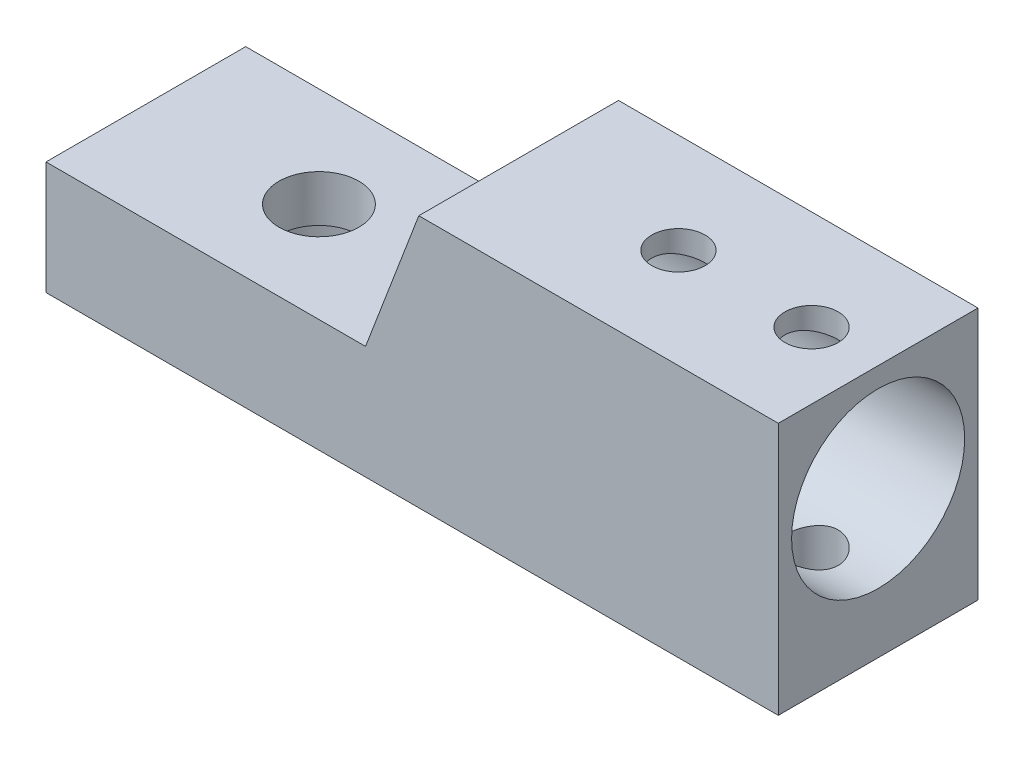
ISO-10303-21;
HEADER;
FILE_DESCRIPTION(('STEP AP214'),'2;1');
FILE_NAME('part.step','',(''),(''),'','','');
FILE_SCHEMA(('AUTOMOTIVE_DESIGN { 1 0 10303 214 1 1 1 1 }'));
ENDSEC;
DATA;
#1=APPLICATION_CONTEXT('core data for automotive mechanical design processes');
#2=APPLICATION_PROTOCOL_DEFINITION('international standard','automotive_design',2000,#1);
#3=PRODUCT_CONTEXT('',#1,'mechanical');
#4=PRODUCT('Part','Part','',(#3));
#5=PRODUCT_RELATED_PRODUCT_CATEGORY('part','',(#4));
#6=PRODUCT_DEFINITION_FORMATION('','',#4);
#7=PRODUCT_DEFINITION_CONTEXT('part definition',#1,'design');
#8=PRODUCT_DEFINITION('design','',#6,#7);
#9=PRODUCT_DEFINITION_SHAPE('','',#8);
#10=(LENGTH_UNIT() NAMED_UNIT(*) SI_UNIT(.MILLI.,.METRE.));
#11=(NAMED_UNIT(*) PLANE_ANGLE_UNIT() SI_UNIT($,.RADIAN.));
#12=(NAMED_UNIT(*) SI_UNIT($,.STERADIAN.) SOLID_ANGLE_UNIT());
#13=UNCERTAINTY_MEASURE_WITH_UNIT(LENGTH_MEASURE(1.E-05),#10,'distance_accuracy_value','');
#14=(GEOMETRIC_REPRESENTATION_CONTEXT(3) GLOBAL_UNCERTAINTY_ASSIGNED_CONTEXT((#13)) GLOBAL_UNIT_ASSIGNED_CONTEXT((#10,
#11,#12)) REPRESENTATION_CONTEXT('',''));
#15=CARTESIAN_POINT('',(0.,0.,0.));
#16=DIRECTION('',(0.,0.,1.));
#17=DIRECTION('',(1.,0.,0.));
#18=AXIS2_PLACEMENT_3D('',#15,#16,#17);
#19=CARTESIAN_POINT('',(-17.,-11.,0.));
#20=DIRECTION('',(0.,1.,0.));
#21=DIRECTION('',(0.,0.,1.));
#22=AXIS2_PLACEMENT_3D('',#19,#20,#21);
#23=CYLINDRICAL_SURFACE('',#22,3.);
#24=CARTESIAN_POINT('',(-17.,-2.5,0.));
#25=DIRECTION('',(0.,1.,0.));
#26=DIRECTION('',(0.,0.,1.));
#27=AXIS2_PLACEMENT_3D('',#24,#25,#26);
#28=CIRCLE('',#27,3.);
#29=CARTESIAN_POINT('',(-17.,-2.5,3.));
#30=VERTEX_POINT('',#29);
#31=EDGE_CURVE('E120',#30,#30,#28,.T.);
#32=ORIENTED_EDGE('',*,*,#31,.T.);
#33=EDGE_LOOP('',(#32));
#34=FACE_BOUND('',#33,.T.);
#35=CARTESIAN_POINT('',(-17.,-6.,0.));
#36=DIRECTION('',(0.,-1.,0.));
#37=DIRECTION('',(0.,0.,-1.));
#38=AXIS2_PLACEMENT_3D('',#35,#36,#37);
#39=CIRCLE('',#38,3.);
#40=CARTESIAN_POINT('',(-17.,-6.,-3.));
#41=VERTEX_POINT('',#40);
#42=EDGE_CURVE('E41',#41,#41,#39,.F.);
#43=ORIENTED_EDGE('',*,*,#42,.F.);
#44=EDGE_LOOP('',(#43));
#45=FACE_BOUND('',#44,.T.);
#46=ADVANCED_FACE('F37',(#34,#45),#23,.F.);
#47=CARTESIAN_POINT('',(25.,0.,7.5));
#48=DIRECTION('',(0.,0.,1.));
#49=DIRECTION('',(1.,0.,0.));
#50=AXIS2_PLACEMENT_3D('',#47,#48,#49);
#51=PLANE('',#50);
#52=DIRECTION('',(-1.,0.,0.));
#53=VECTOR('',#52,1.);
#54=CARTESIAN_POINT('',(25.,8.,7.5));
#55=LINE('',#54,#53);
#56=CARTESIAN_POINT('',(25.,8.,7.5));
#57=VERTEX_POINT('',#56);
#58=CARTESIAN_POINT('',(-2.,8.,7.5));
#59=VERTEX_POINT('',#58);
#60=EDGE_CURVE('E186',#57,#59,#55,.T.);
#61=ORIENTED_EDGE('',*,*,#60,.T.);
#62=DIRECTION('',(0.35599532759199,0.934487734928967,0.));
#63=VECTOR('',#62,1.);
#64=CARTESIAN_POINT('',(-6.,-2.5,7.5));
#65=LINE('',#64,#63);
#66=CARTESIAN_POINT('',(-6.00000000000001,-2.5,7.5));
#67=VERTEX_POINT('',#66);
#68=EDGE_CURVE('E11',#59,#67,#65,.F.);
#69=ORIENTED_EDGE('',*,*,#68,.T.);
#70=DIRECTION('',(1.,0.,0.));
#71=VECTOR('',#70,1.);
#72=CARTESIAN_POINT('',(-30.,-2.5,7.5));
#73=LINE('',#72,#71);
#74=CARTESIAN_POINT('',(-30.,-2.5,7.5));
#75=VERTEX_POINT('',#74);
#76=EDGE_CURVE('E122',#75,#67,#73,.T.);
#77=ORIENTED_EDGE('',*,*,#76,.F.);
#78=DIRECTION('',(0.,1.,0.));
#79=VECTOR('',#78,1.);
#80=CARTESIAN_POINT('',(-30.,-11.,7.5));
#81=LINE('',#80,#79);
#82=CARTESIAN_POINT('',(-30.,-11.,7.5));
#83=VERTEX_POINT('',#82);
#84=EDGE_CURVE('E111',#83,#75,#81,.T.);
#85=ORIENTED_EDGE('',*,*,#84,.F.);
#86=DIRECTION('',(-1.,0.,0.));
#87=VECTOR('',#86,1.);
#88=CARTESIAN_POINT('',(25.,-11.,7.5));
#89=LINE('',#88,#87);
#90=CARTESIAN_POINT('',(25.,-11.,7.5));
#91=VERTEX_POINT('',#90);
#92=EDGE_CURVE('E102',#91,#83,#89,.T.);
#93=ORIENTED_EDGE('',*,*,#92,.F.);
#94=DIRECTION('',(0.,1.,0.));
#95=VECTOR('',#94,1.);
#96=CARTESIAN_POINT('',(25.,0.,7.5));
#97=LINE('',#96,#95);
#98=EDGE_CURVE('E189',#91,#57,#97,.T.);
#99=ORIENTED_EDGE('',*,*,#98,.T.);
#100=EDGE_LOOP('',(#61,#69,#77,#85,#93,#99));
#101=FACE_BOUND('',#100,.T.);
#102=ADVANCED_FACE('F177',(#101),#51,.T.);
#103=CARTESIAN_POINT('',(25.,-11.,0.));
#104=DIRECTION('',(0.,1.,0.));
#105=DIRECTION('',(0.,0.,1.));
#106=AXIS2_PLACEMENT_3D('',#103,#104,#105);
#107=PLANE('',#106);
#108=CARTESIAN_POINT('',(-17.,-11.,0.));
#109=DIRECTION('',(0.,-1.,0.));
#110=DIRECTION('',(0.,0.,-1.));
#111=AXIS2_PLACEMENT_3D('',#108,#109,#110);
#112=CIRCLE('',#111,6.);
#113=CARTESIAN_POINT('',(-17.,-11.,-6.));
#114=VERTEX_POINT('',#113);
#115=EDGE_CURVE('E268',#114,#114,#112,.T.);
#116=ORIENTED_EDGE('',*,*,#115,.F.);
#117=EDGE_LOOP('',(#116));
#118=FACE_BOUND('',#117,.T.);
#119=CARTESIAN_POINT('',(10.,-11.,0.));
#120=DIRECTION('',(0.,1.,0.));
#121=DIRECTION('',(0.,0.,1.));
#122=AXIS2_PLACEMENT_3D('',#119,#120,#121);
#123=CIRCLE('',#122,2.);
#124=CARTESIAN_POINT('',(10.,-11.,2.));
#125=VERTEX_POINT('',#124);
#126=EDGE_CURVE('E130',#125,#125,#123,.T.);
#127=ORIENTED_EDGE('',*,*,#126,.T.);
#128=EDGE_LOOP('',(#127));
#129=FACE_BOUND('',#128,.T.);
#130=CARTESIAN_POINT('',(20.,-11.,0.));
#131=DIRECTION('',(0.,1.,0.));
#132=DIRECTION('',(0.,0.,1.));
#133=AXIS2_PLACEMENT_3D('',#130,#131,#132);
#134=CIRCLE('',#133,2.);
#135=CARTESIAN_POINT('',(20.,-11.,2.));
#136=VERTEX_POINT('',#135);
#137=EDGE_CURVE('E131',#136,#136,#134,.T.);
#138=ORIENTED_EDGE('',*,*,#137,.T.);
#139=EDGE_LOOP('',(#138));
#140=FACE_BOUND('',#139,.T.);
#141=ORIENTED_EDGE('',*,*,#92,.T.);
#142=DIRECTION('',(0.,0.,1.));
#143=VECTOR('',#142,1.);
#144=CARTESIAN_POINT('',(-30.,-11.,7.5));
#145=LINE('',#144,#143);
#146=CARTESIAN_POINT('',(-30.,-11.,-7.5));
#147=VERTEX_POINT('',#146);
#148=EDGE_CURVE('E108',#147,#83,#145,.T.);
#149=ORIENTED_EDGE('',*,*,#148,.F.);
#150=DIRECTION('',(-1.,0.,0.));
#151=VECTOR('',#150,1.);
#152=CARTESIAN_POINT('',(25.,-11.,-7.5));
#153=LINE('',#152,#151);
#154=CARTESIAN_POINT('',(25.,-11.,-7.5));
#155=VERTEX_POINT('',#154);
#156=EDGE_CURVE('E90',#155,#147,#153,.T.);
#157=ORIENTED_EDGE('',*,*,#156,.F.);
#158=DIRECTION('',(0.,0.,-1.));
#159=VECTOR('',#158,1.);
#160=CARTESIAN_POINT('',(25.,-11.,0.));
#161=LINE('',#160,#159);
#162=EDGE_CURVE('E212',#91,#155,#161,.T.);
#163=ORIENTED_EDGE('',*,*,#162,.F.);
#164=EDGE_LOOP('',(#141,#149,#157,#163));
#165=FACE_BOUND('',#164,.T.);
#166=ADVANCED_FACE('F113',(#118,#129,#140,#165),#107,.F.);
#167=CARTESIAN_POINT('',(25.,0.,-7.5));
#168=DIRECTION('',(0.,0.,1.));
#169=DIRECTION('',(1.,0.,0.));
#170=AXIS2_PLACEMENT_3D('',#167,#168,#169);
#171=PLANE('',#170);
#172=ORIENTED_EDGE('',*,*,#156,.T.);
#173=DIRECTION('',(0.,1.,0.));
#174=VECTOR('',#173,1.);
#175=CARTESIAN_POINT('',(-30.,-11.,-7.5));
#176=LINE('',#175,#174);
#177=CARTESIAN_POINT('',(-30.,-2.5,-7.5));
#178=VERTEX_POINT('',#177);
#179=EDGE_CURVE('E94',#147,#178,#176,.T.);
#180=ORIENTED_EDGE('',*,*,#179,.T.);
#181=DIRECTION('',(-1.,0.,0.));
#182=VECTOR('',#181,1.);
#183=CARTESIAN_POINT('',(-30.,-2.5,-7.5));
#184=LINE('',#183,#182);
#185=CARTESIAN_POINT('',(-6.00000000000001,-2.5,-7.5));
#186=VERTEX_POINT('',#185);
#187=EDGE_CURVE('E116',#186,#178,#184,.T.);
#188=ORIENTED_EDGE('',*,*,#187,.F.);
#189=DIRECTION('',(-0.35599532759199,-0.934487734928967,0.));
#190=VECTOR('',#189,1.);
#191=CARTESIAN_POINT('',(-1.23960396039598,9.99603960396045,-7.5));
#192=LINE('',#191,#190);
#193=CARTESIAN_POINT('',(-2.,8.,-7.5));
#194=VERTEX_POINT('',#193);
#195=EDGE_CURVE('E46',#186,#194,#192,.F.);
#196=ORIENTED_EDGE('',*,*,#195,.T.);
#197=DIRECTION('',(-1.,0.,0.));
#198=VECTOR('',#197,1.);
#199=CARTESIAN_POINT('',(25.,8.,-7.5));
#200=LINE('',#199,#198);
#201=CARTESIAN_POINT('',(25.,8.,-7.5));
#202=VERTEX_POINT('',#201);
#203=EDGE_CURVE('E103',#202,#194,#200,.T.);
#204=ORIENTED_EDGE('',*,*,#203,.F.);
#205=DIRECTION('',(0.,1.,0.));
#206=VECTOR('',#205,1.);
#207=CARTESIAN_POINT('',(25.,0.,-7.5));
#208=LINE('',#207,#206);
#209=EDGE_CURVE('E97',#155,#202,#208,.T.);
#210=ORIENTED_EDGE('',*,*,#209,.F.);
#211=EDGE_LOOP('',(#172,#180,#188,#196,#204,#210));
#212=FACE_BOUND('',#211,.T.);
#213=ADVANCED_FACE('F92',(#212),#171,.F.);
#214=CARTESIAN_POINT('',(25.,0.,0.));
#215=DIRECTION('',(-1.,0.,0.));
#216=DIRECTION('',(0.,0.,1.));
#217=AXIS2_PLACEMENT_3D('',#214,#215,#216);
#218=CYLINDRICAL_SURFACE('',#217,6.5);
#219=CARTESIAN_POINT('',(10.,-6.18465843842649,2.));
#220=CARTESIAN_POINT('',(10.1094478166652,-6.18465930196192,1.9999990095568));
#221=CARTESIAN_POINT('',(10.2189054848382,-6.18759551962699,1.99098535833565));
#222=CARTESIAN_POINT('',(10.4346111816852,-6.19897317486936,1.95526805100871));
#223=CARTESIAN_POINT('',(10.5408582544629,-6.20741623543611,1.92855917969017));
#224=CARTESIAN_POINT('',(10.746987807974,-6.22876273970596,1.85845185053104));
#225=CARTESIAN_POINT('',(10.8468809407582,-6.24165847214778,1.8150822317129));
#226=CARTESIAN_POINT('',(11.0379998508988,-6.27044669026987,1.71298018316394));
#227=CARTESIAN_POINT('',(11.1292241832341,-6.28633967425533,1.65424519824938));
#228=CARTESIAN_POINT('',(11.303453569472,-6.31992519486664,1.52098542811857));
#229=CARTESIAN_POINT('',(11.3861274234922,-6.33765756932836,1.44603755808562));
#230=CARTESIAN_POINT('',(11.5379537180837,-6.37258438430366,1.28338536224739));
#231=CARTESIAN_POINT('',(11.607104329982,-6.38977875180184,1.19567931401686));
#232=CARTESIAN_POINT('',(11.7313736379995,-6.4221466710909,1.00762969104172));
#233=CARTESIAN_POINT('',(11.7861525678529,-6.43726783390859,0.907051779246697));
#234=CARTESIAN_POINT('',(11.8778889420094,-6.46332130744831,0.697566498611637));
#235=CARTESIAN_POINT('',(11.9148504403184,-6.47425457092804,0.588661031083086));
#236=CARTESIAN_POINT('',(11.9688007146125,-6.49041842306583,0.369078789668962));
#237=CARTESIAN_POINT('',(11.986355276722,-6.49581021502431,0.258553108996815));
#238=CARTESIAN_POINT('',(12.0027846064267,-6.50085231846729,0.0360024805210005));
#239=CARTESIAN_POINT('',(12.0016634945557,-6.50050389645219,-0.0760221311138332));
#240=CARTESIAN_POINT('',(11.9811484452717,-6.49421773787331,-0.294413564221151));
#241=CARTESIAN_POINT('',(11.9623675952985,-6.48846753941673,-0.400844233271027));
#242=CARTESIAN_POINT('',(11.9080704095831,-6.47225351889556,-0.608962506037097));
#243=CARTESIAN_POINT('',(11.8725529940272,-6.46178939269855,-0.710649803253991));
#244=CARTESIAN_POINT('',(11.7853887565814,-6.43706860960458,-0.907825983957049));
#245=CARTESIAN_POINT('',(11.7335532609179,-6.42276789460409,-1.00322571036047));
#246=CARTESIAN_POINT('',(11.6153748075945,-6.39188462555487,-1.18416561152014));
#247=CARTESIAN_POINT('',(11.5490282680811,-6.37530150850161,-1.26970334400255));
#248=CARTESIAN_POINT('',(11.4005508893297,-6.34083036356049,-1.43214818143839));
#249=CARTESIAN_POINT('',(11.3178900149194,-6.32291668577951,-1.50856604633594));
#250=CARTESIAN_POINT('',(11.1407560606776,-6.28838540910676,-1.64659789158783));
#251=CARTESIAN_POINT('',(11.0462816782687,-6.27176795346722,-1.70821023726841));
#252=CARTESIAN_POINT('',(10.8468569317561,-6.24158384080898,-1.81542815284785));
#253=CARTESIAN_POINT('',(10.7418065852194,-6.22805120968131,-1.86085804249382));
#254=CARTESIAN_POINT('',(10.5250312826704,-6.20596978963966,-1.93323233909798));
#255=CARTESIAN_POINT('',(10.4133086528347,-6.19741927485068,-1.96018314804153));
#256=CARTESIAN_POINT('',(10.1910354718452,-6.18665163283591,-1.99390183839658));
#257=CARTESIAN_POINT('',(10.0806095197673,-6.18420022355391,-2.00141677206859));
#258=CARTESIAN_POINT('',(9.86006861403926,-6.18525890294931,-1.99814331840788));
#259=CARTESIAN_POINT('',(9.74995361655913,-6.18876810464339,-1.98735765434067));
#260=CARTESIAN_POINT('',(9.53633739526088,-6.20112183020873,-1.94845591378718));
#261=CARTESIAN_POINT('',(9.43273743020314,-6.2098155474974,-1.92082922102701));
#262=CARTESIAN_POINT('',(9.23165311791169,-6.23140033431748,-1.84960144317458));
#263=CARTESIAN_POINT('',(9.13416975068449,-6.24429207442193,-1.80599780585853));
#264=CARTESIAN_POINT('',(8.94506908836895,-6.27326823548526,-1.70266083632211));
#265=CARTESIAN_POINT('',(8.85369214786031,-6.28943187401987,-1.642510447689));
#266=CARTESIAN_POINT('',(8.68205645444877,-6.32296420859206,-1.50827755720534));
#267=CARTESIAN_POINT('',(8.60180051059716,-6.34033320743476,-1.43419154645756));
#268=CARTESIAN_POINT('',(8.45137542136322,-6.37515982745186,-1.27066455897644));
#269=CARTESIAN_POINT('',(8.38173805229887,-6.39259321140603,-1.18072798127101));
#270=CARTESIAN_POINT('',(8.25852596385662,-6.4248880498859,-0.990026292988484));
#271=CARTESIAN_POINT('',(8.20495048188052,-6.43974962650362,-0.889261696820765));
#272=CARTESIAN_POINT('',(8.11589889700059,-6.46513895511409,-0.680404349890929));
#273=CARTESIAN_POINT('',(8.08028985839773,-6.47569842330933,-0.572372332564445));
#274=CARTESIAN_POINT('',(8.02785823424431,-6.49143353701507,-0.351472208803097));
#275=CARTESIAN_POINT('',(8.01102996689852,-6.49661081078226,-0.238605575732807));
#276=CARTESIAN_POINT('',(7.99708774938302,-6.50089371028741,-0.0161425784559015));
#277=CARTESIAN_POINT('',(7.99920450881628,-6.50023627237803,0.0934015930792316));
#278=CARTESIAN_POINT('',(8.02124019750521,-6.49348761016137,0.310503921550124));
#279=CARTESIAN_POINT('',(8.04115802587313,-6.48739672187997,0.418062200881386));
#280=CARTESIAN_POINT('',(8.0977458122438,-6.47053765408911,0.626896153328702));
#281=CARTESIAN_POINT('',(8.13421524667688,-6.45982553572913,0.728231001104438));
#282=CARTESIAN_POINT('',(8.22269063398323,-6.43482974334373,0.923394028801654));
#283=CARTESIAN_POINT('',(8.27469921078922,-6.42054546619161,1.01722093754076));
#284=CARTESIAN_POINT('',(8.39477473631908,-6.38931014060288,1.19809140790342));
#285=CARTESIAN_POINT('',(8.463317333803,-6.37228632231703,1.28480651115009));
#286=CARTESIAN_POINT('',(8.61366948951745,-6.33770998123227,1.44576009155785));
#287=CARTESIAN_POINT('',(8.69548295904987,-6.32015730380927,1.51999487724007));
#288=CARTESIAN_POINT('',(8.87317697614795,-6.28584951367575,1.65626040321864));
#289=CARTESIAN_POINT('',(8.96942235514311,-6.26913756348218,1.71782754366812));
#290=CARTESIAN_POINT('',(9.17139075347286,-6.23912274318891,1.82384213502379));
#291=CARTESIAN_POINT('',(9.27710963003581,-6.22581839266759,1.86829702453285));
#292=CARTESIAN_POINT('',(9.48478819820058,-6.20530356949791,1.93528263381637));
#293=CARTESIAN_POINT('',(9.58616631120831,-6.19763764909695,1.95948210366414));
#294=CARTESIAN_POINT('',(9.79169373301637,-6.18731524290854,1.99183943194677));
#295=CARTESIAN_POINT('',(9.89584240542432,-6.18465761663054,2.00000094256957));
#296=CARTESIAN_POINT('',(10.,-6.18465843842649,2.));
#297=B_SPLINE_CURVE_WITH_KNOTS('',3,(#219,#220,#221,#222,#223,#224,#225,#226,#227,#228,#229,
#230,#231,#232,#233,#234,#235,#236,#237,#238,#239,#240,#241,#242,#243,#244,#245,#246,#247,#248,
#249,#250,#251,#252,#253,#254,#255,#256,#257,#258,#259,#260,#261,#262,#263,#264,#265,#266,#267,
#268,#269,#270,#271,#272,#273,#274,#275,#276,#277,#278,#279,#280,#281,#282,#283,#284,#285,#286,
#287,#288,#289,#290,#291,#292,#293,#294,#295,#296),.UNSPECIFIED.,.T.,.F.,(4,2,2,2,2,2,2,2,2,2,2,
2,2,2,2,2,2,2,2,2,2,2,2,2,2,2,2,2,2,2,2,2,2,2,2,2,2,2,4),(0.,0.327958904824528,
0.656014510157334,0.98350480582627,1.31104959615494,1.64848092871026,1.9859578587312,
2.33081172384083,2.67558708716039,3.01002171776409,3.34438256088806,3.66754797200325,
3.99073423603839,4.3178037154465,4.64495401879588,4.98534121479607,5.32576597561372,
5.66978125697086,6.0136772956479,6.34414407424117,6.67456168122459,6.99580726669392,
7.31710419166197,7.64738828171957,7.9777556467148,8.32133560221227,8.66489924238097,
9.00588210329354,9.34676177779273,9.6738643713567,10.0009467370162,10.3241681048257,
10.6474440825282,10.9814486359995,11.3155518095369,11.6602881883484,12.0048745424383,
12.3170524660658,12.6291592918299),.UNSPECIFIED.);
#298=CARTESIAN_POINT('',(10.,-6.18465843842649,2.));
#299=VERTEX_POINT('',#298);
#300=EDGE_CURVE('E198',#299,#299,#297,.T.);
#301=ORIENTED_EDGE('',*,*,#300,.F.);
#302=EDGE_LOOP('',(#301));
#303=FACE_BOUND('',#302,.T.);
#304=CARTESIAN_POINT('',(10.,6.18465843842649,2.));
#305=CARTESIAN_POINT('',(9.89055218333477,6.18465930196192,1.9999990095568));
#306=CARTESIAN_POINT('',(9.78109451516176,6.18759551962699,1.99098535833565));
#307=CARTESIAN_POINT('',(9.5653888183148,6.19897317486936,1.95526805100871));
#308=CARTESIAN_POINT('',(9.45914174553714,6.20741623543611,1.92855917969017));
#309=CARTESIAN_POINT('',(9.25301219202596,6.22876273970596,1.85845185053104));
#310=CARTESIAN_POINT('',(9.15311905924181,6.24165847214778,1.8150822317129));
#311=CARTESIAN_POINT('',(8.96200014910121,6.27044669026987,1.71298018316394));
#312=CARTESIAN_POINT('',(8.87077581676594,6.28633967425533,1.65424519824938));
#313=CARTESIAN_POINT('',(8.69654643052799,6.31992519486664,1.52098542811857));
#314=CARTESIAN_POINT('',(8.61387257650782,6.33765756932836,1.44603755808562));
#315=CARTESIAN_POINT('',(8.46204628191629,6.37258438430366,1.28338536224739));
#316=CARTESIAN_POINT('',(8.392895670018,6.38977875180184,1.19567931401686));
#317=CARTESIAN_POINT('',(8.26862636200054,6.4221466710909,1.00762969104172));
#318=CARTESIAN_POINT('',(8.21384743214713,6.43726783390859,0.907051779246697));
#319=CARTESIAN_POINT('',(8.12211105799065,6.46332130744831,0.697566498611637));
#320=CARTESIAN_POINT('',(8.08514955968164,6.47425457092804,0.588661031083086));
#321=CARTESIAN_POINT('',(8.03119928538751,6.49041842306583,0.369078789668962));
#322=CARTESIAN_POINT('',(8.01364472327802,6.49581021502431,0.258553108996815));
#323=CARTESIAN_POINT('',(7.99721539357325,6.50085231846729,0.0360024805210005));
#324=CARTESIAN_POINT('',(7.99833650544427,6.50050389645219,-0.0760221311138332));
#325=CARTESIAN_POINT('',(8.01885155472825,6.49421773787331,-0.294413564221151));
#326=CARTESIAN_POINT('',(8.03763240470151,6.48846753941673,-0.400844233271027));
#327=CARTESIAN_POINT('',(8.09192959041688,6.47225351889556,-0.608962506037097));
#328=CARTESIAN_POINT('',(8.1274470059728,6.46178939269855,-0.710649803253991));
#329=CARTESIAN_POINT('',(8.21461124341862,6.43706860960458,-0.907825983957049));
#330=CARTESIAN_POINT('',(8.26644673908213,6.42276789460409,-1.00322571036047));
#331=CARTESIAN_POINT('',(8.38462519240552,6.39188462555487,-1.18416561152014));
#332=CARTESIAN_POINT('',(8.45097173191889,6.37530150850161,-1.26970334400255));
#333=CARTESIAN_POINT('',(8.59944911067027,6.34083036356049,-1.43214818143839));
#334=CARTESIAN_POINT('',(8.68210998508059,6.32291668577951,-1.50856604633594));
#335=CARTESIAN_POINT('',(8.85924393932243,6.28838540910676,-1.64659789158783));
#336=CARTESIAN_POINT('',(8.95371832173134,6.27176795346722,-1.70821023726841));
#337=CARTESIAN_POINT('',(9.15314306824387,6.24158384080898,-1.81542815284785));
#338=CARTESIAN_POINT('',(9.25819341478064,6.22805120968131,-1.86085804249382));
#339=CARTESIAN_POINT('',(9.47496871732961,6.20596978963966,-1.93323233909798));
#340=CARTESIAN_POINT('',(9.58669134716533,6.19741927485068,-1.96018314804153));
#341=CARTESIAN_POINT('',(9.80896452815476,6.18665163283591,-1.99390183839658));
#342=CARTESIAN_POINT('',(9.9193904802327,6.18420022355391,-2.00141677206859));
#343=CARTESIAN_POINT('',(10.1399313859607,6.18525890294931,-1.99814331840788));
#344=CARTESIAN_POINT('',(10.2500463834409,6.18876810464339,-1.98735765434067));
#345=CARTESIAN_POINT('',(10.4636626047391,6.20112183020873,-1.94845591378718));
#346=CARTESIAN_POINT('',(10.5672625697969,6.2098155474974,-1.92082922102701));
#347=CARTESIAN_POINT('',(10.7683468820883,6.23140033431748,-1.84960144317458));
#348=CARTESIAN_POINT('',(10.8658302493155,6.24429207442193,-1.80599780585853));
#349=CARTESIAN_POINT('',(11.0549309116311,6.27326823548526,-1.70266083632211));
#350=CARTESIAN_POINT('',(11.1463078521397,6.28943187401987,-1.642510447689));
#351=CARTESIAN_POINT('',(11.3179435455512,6.32296420859206,-1.50827755720534));
#352=CARTESIAN_POINT('',(11.3981994894028,6.34033320743476,-1.43419154645756));
#353=CARTESIAN_POINT('',(11.5486245786368,6.37515982745186,-1.27066455897644));
#354=CARTESIAN_POINT('',(11.6182619477011,6.39259321140603,-1.18072798127101));
#355=CARTESIAN_POINT('',(11.7414740361434,6.4248880498859,-0.990026292988484));
#356=CARTESIAN_POINT('',(11.7950495181195,6.43974962650362,-0.889261696820765));
#357=CARTESIAN_POINT('',(11.8841011029994,6.46513895511409,-0.680404349890929));
#358=CARTESIAN_POINT('',(11.9197101416023,6.47569842330933,-0.572372332564445));
#359=CARTESIAN_POINT('',(11.9721417657557,6.49143353701507,-0.351472208803097));
#360=CARTESIAN_POINT('',(11.9889700331015,6.49661081078226,-0.238605575732807));
#361=CARTESIAN_POINT('',(12.002912250617,6.50089371028741,-0.0161425784559015));
#362=CARTESIAN_POINT('',(12.0007954911837,6.50023627237803,0.0934015930792316));
#363=CARTESIAN_POINT('',(11.9787598024948,6.49348761016137,0.310503921550124));
#364=CARTESIAN_POINT('',(11.9588419741269,6.48739672187997,0.418062200881386));
#365=CARTESIAN_POINT('',(11.9022541877562,6.47053765408911,0.626896153328702));
#366=CARTESIAN_POINT('',(11.8657847533231,6.45982553572913,0.728231001104438));
#367=CARTESIAN_POINT('',(11.7773093660168,6.43482974334373,0.923394028801654));
#368=CARTESIAN_POINT('',(11.7253007892108,6.42054546619161,1.01722093754076));
#369=CARTESIAN_POINT('',(11.6052252636809,6.38931014060288,1.19809140790342));
#370=CARTESIAN_POINT('',(11.536682666197,6.37228632231703,1.28480651115009));
#371=CARTESIAN_POINT('',(11.3863305104826,6.33770998123227,1.44576009155785));
#372=CARTESIAN_POINT('',(11.3045170409501,6.32015730380927,1.51999487724007));
#373=CARTESIAN_POINT('',(11.126823023852,6.28584951367575,1.65626040321864));
#374=CARTESIAN_POINT('',(11.0305776448569,6.26913756348218,1.71782754366812));
#375=CARTESIAN_POINT('',(10.8286092465271,6.23912274318891,1.82384213502379));
#376=CARTESIAN_POINT('',(10.7228903699642,6.22581839266759,1.86829702453285));
#377=CARTESIAN_POINT('',(10.5152118017994,6.20530356949791,1.93528263381637));
#378=CARTESIAN_POINT('',(10.4138336887917,6.19763764909695,1.95948210366414));
#379=CARTESIAN_POINT('',(10.2083062669836,6.18731524290854,1.99183943194677));
#380=CARTESIAN_POINT('',(10.1041575945757,6.18465761663054,2.00000094256957));
#381=CARTESIAN_POINT('',(10.,6.18465843842649,2.));
#382=B_SPLINE_CURVE_WITH_KNOTS('',3,(#304,#305,#306,#307,#308,#309,#310,#311,#312,#313,#314,
#315,#316,#317,#318,#319,#320,#321,#322,#323,#324,#325,#326,#327,#328,#329,#330,#331,#332,#333,
#334,#335,#336,#337,#338,#339,#340,#341,#342,#343,#344,#345,#346,#347,#348,#349,#350,#351,#352,
#353,#354,#355,#356,#357,#358,#359,#360,#361,#362,#363,#364,#365,#366,#367,#368,#369,#370,#371,
#372,#373,#374,#375,#376,#377,#378,#379,#380,#381),.UNSPECIFIED.,.T.,.F.,(4,2,2,2,2,2,2,2,2,2,2,
2,2,2,2,2,2,2,2,2,2,2,2,2,2,2,2,2,2,2,2,2,2,2,2,2,2,2,4),(0.,0.327958904824528,
0.656014510157334,0.983504805826269,1.31104959615494,1.64848092871026,1.9859578587312,
2.33081172384083,2.67558708716039,3.01002171776409,3.34438256088806,3.66754797200325,
3.99073423603839,4.3178037154465,4.64495401879588,4.98534121479607,5.32576597561372,
5.66978125697086,6.0136772956479,6.34414407424117,6.67456168122459,6.99580726669392,
7.31710419166197,7.64738828171957,7.9777556467148,8.32133560221227,8.66489924238097,
9.00588210329355,9.34676177779273,9.6738643713567,10.0009467370162,10.3241681048257,
10.6474440825282,10.9814486359995,11.3155518095369,11.6602881883484,12.0048745424383,
12.3170524660658,12.6291592918299),.UNSPECIFIED.);
#383=CARTESIAN_POINT('',(10.,6.18465843842649,2.));
#384=VERTEX_POINT('',#383);
#385=EDGE_CURVE('E220',#384,#384,#382,.T.);
#386=ORIENTED_EDGE('',*,*,#385,.F.);
#387=EDGE_LOOP('',(#386));
#388=FACE_BOUND('',#387,.T.);
#389=CARTESIAN_POINT('',(20.,-6.18465843842649,2.));
#390=CARTESIAN_POINT('',(20.1094478166652,-6.18465930196192,1.9999990095568));
#391=CARTESIAN_POINT('',(20.2189054848382,-6.18759551962699,1.99098535833566));
#392=CARTESIAN_POINT('',(20.4346111816852,-6.19897317486936,1.95526805100872));
#393=CARTESIAN_POINT('',(20.5408582544629,-6.2074162354361,1.92855917969018));
#394=CARTESIAN_POINT('',(20.746987807974,-6.22876273970596,1.85845185053105));
#395=CARTESIAN_POINT('',(20.8468809407582,-6.24165847214777,1.81508223171291));
#396=CARTESIAN_POINT('',(21.0379998508988,-6.27044669026987,1.71298018316394));
#397=CARTESIAN_POINT('',(21.1292241832341,-6.28633967425533,1.65424519824938));
#398=CARTESIAN_POINT('',(21.303453569472,-6.31992519486664,1.52098542811858));
#399=CARTESIAN_POINT('',(21.3861274234922,-6.33765756932836,1.44603755808562));
#400=CARTESIAN_POINT('',(21.5379537180837,-6.37258438430366,1.28338536224739));
#401=CARTESIAN_POINT('',(21.607104329982,-6.38977875180184,1.19567931401686));
#402=CARTESIAN_POINT('',(21.7313736379995,-6.4221466710909,1.00762969104172));
#403=CARTESIAN_POINT('',(21.7861525678529,-6.43726783390859,0.907051779246697));
#404=CARTESIAN_POINT('',(21.8778889420094,-6.46332130744831,0.697566498611638));
#405=CARTESIAN_POINT('',(21.9148504403184,-6.47425457092804,0.588661031083087));
#406=CARTESIAN_POINT('',(21.9688007146125,-6.49041842306583,0.369078789668963));
#407=CARTESIAN_POINT('',(21.986355276722,-6.49581021502431,0.258553108996815));
#408=CARTESIAN_POINT('',(22.0027846064268,-6.50085231846729,0.0360024805209994));
#409=CARTESIAN_POINT('',(22.0016634945557,-6.50050389645219,-0.0760221311138346));
#410=CARTESIAN_POINT('',(21.9811484452718,-6.49421773787331,-0.294413564221153));
#411=CARTESIAN_POINT('',(21.9623675952985,-6.48846753941673,-0.40084423327103));
#412=CARTESIAN_POINT('',(21.9080704095831,-6.47225351889556,-0.6089625060371));
#413=CARTESIAN_POINT('',(21.8725529940272,-6.46178939269855,-0.710649803253994));
#414=CARTESIAN_POINT('',(21.7853887565814,-6.43706860960458,-0.907825983957053));
#415=CARTESIAN_POINT('',(21.7335532609179,-6.42276789460409,-1.00322571036048));
#416=CARTESIAN_POINT('',(21.6153748075945,-6.39188462555487,-1.18416561152014));
#417=CARTESIAN_POINT('',(21.5490282680811,-6.37530150850161,-1.26970334400256));
#418=CARTESIAN_POINT('',(21.4005508893297,-6.34083036356049,-1.43214818143839));
#419=CARTESIAN_POINT('',(21.3178900149194,-6.32291668577951,-1.50856604633594));
#420=CARTESIAN_POINT('',(21.1407560606776,-6.28838540910675,-1.64659789158783));
#421=CARTESIAN_POINT('',(21.0462816782687,-6.27176795346722,-1.70821023726841));
#422=CARTESIAN_POINT('',(20.8468569317561,-6.24158384080898,-1.81542815284785));
#423=CARTESIAN_POINT('',(20.7418065852194,-6.22805120968131,-1.86085804249383));
#424=CARTESIAN_POINT('',(20.5250312826704,-6.20596978963966,-1.93323233909799));
#425=CARTESIAN_POINT('',(20.4133086528347,-6.19741927485068,-1.96018314804153));
#426=CARTESIAN_POINT('',(20.1910354718452,-6.18665163283591,-1.99390183839659));
#427=CARTESIAN_POINT('',(20.0806095197673,-6.18420022355391,-2.00141677206859));
#428=CARTESIAN_POINT('',(19.8600686140393,-6.18525890294931,-1.99814331840789));
#429=CARTESIAN_POINT('',(19.7499536165591,-6.18876810464339,-1.98735765434068));
#430=CARTESIAN_POINT('',(19.5363373952609,-6.20112183020873,-1.94845591378718));
#431=CARTESIAN_POINT('',(19.4327374302031,-6.2098155474974,-1.92082922102701));
#432=CARTESIAN_POINT('',(19.2316531179117,-6.23140033431748,-1.84960144317458));
#433=CARTESIAN_POINT('',(19.1341697506845,-6.24429207442193,-1.80599780585854));
#434=CARTESIAN_POINT('',(18.9450690883689,-6.27326823548526,-1.70266083632212));
#435=CARTESIAN_POINT('',(18.8536921478603,-6.28943187401987,-1.64251044768901));
#436=CARTESIAN_POINT('',(18.6820564544488,-6.32296420859206,-1.50827755720534));
#437=CARTESIAN_POINT('',(18.6018005105972,-6.34033320743476,-1.43419154645756));
#438=CARTESIAN_POINT('',(18.4513754213632,-6.37515982745186,-1.27066455897645));
#439=CARTESIAN_POINT('',(18.3817380522989,-6.39259321140603,-1.18072798127102));
#440=CARTESIAN_POINT('',(18.2585259638566,-6.4248880498859,-0.990026292988486));
#441=CARTESIAN_POINT('',(18.2049504818805,-6.43974962650362,-0.889261696820768));
#442=CARTESIAN_POINT('',(18.1158988970006,-6.46513895511408,-0.680404349890931));
#443=CARTESIAN_POINT('',(18.0802898583977,-6.47569842330933,-0.572372332564448));
#444=CARTESIAN_POINT('',(18.0278582342443,-6.49143353701507,-0.351472208803099));
#445=CARTESIAN_POINT('',(18.0110299668985,-6.49661081078226,-0.238605575732807));
#446=CARTESIAN_POINT('',(17.997087749383,-6.50089371028741,-0.0161425784559013));
#447=CARTESIAN_POINT('',(17.9992045088163,-6.50023627237803,0.0934015930792316));
#448=CARTESIAN_POINT('',(18.0212401975052,-6.49348761016137,0.310503921550124));
#449=CARTESIAN_POINT('',(18.0411580258731,-6.48739672187997,0.418062200881387));
#450=CARTESIAN_POINT('',(18.0977458122438,-6.47053765408911,0.626896153328705));
#451=CARTESIAN_POINT('',(18.1342152466769,-6.45982553572913,0.728231001104441));
#452=CARTESIAN_POINT('',(18.2226906339832,-6.43482974334373,0.923394028801658));
#453=CARTESIAN_POINT('',(18.2746992107892,-6.4205454661916,1.01722093754076));
#454=CARTESIAN_POINT('',(18.3947747363191,-6.38931014060288,1.19809140790342));
#455=CARTESIAN_POINT('',(18.463317333803,-6.37228632231703,1.28480651115009));
#456=CARTESIAN_POINT('',(18.6136694895174,-6.33770998123227,1.44576009155786));
#457=CARTESIAN_POINT('',(18.6954829590499,-6.32015730380927,1.51999487724008));
#458=CARTESIAN_POINT('',(18.8731769761479,-6.28584951367575,1.65626040321865));
#459=CARTESIAN_POINT('',(18.9694223551431,-6.26913756348217,1.71782754366813));
#460=CARTESIAN_POINT('',(19.1713907534729,-6.23912274318891,1.8238421350238));
#461=CARTESIAN_POINT('',(19.2771096300358,-6.22581839266759,1.86829702453285));
#462=CARTESIAN_POINT('',(19.4847881982006,-6.20530356949791,1.93528263381638));
#463=CARTESIAN_POINT('',(19.5861663112083,-6.19763764909695,1.95948210366415));
#464=CARTESIAN_POINT('',(19.7916937330164,-6.18731524290854,1.99183943194677));
#465=CARTESIAN_POINT('',(19.8958424054243,-6.18465761663054,2.00000094256957));
#466=CARTESIAN_POINT('',(20.,-6.18465843842649,2.));
#467=B_SPLINE_CURVE_WITH_KNOTS('',3,(#389,#390,#391,#392,#393,#394,#395,#396,#397,#398,#399,
#400,#401,#402,#403,#404,#405,#406,#407,#408,#409,#410,#411,#412,#413,#414,#415,#416,#417,#418,
#419,#420,#421,#422,#423,#424,#425,#426,#427,#428,#429,#430,#431,#432,#433,#434,#435,#436,#437,
#438,#439,#440,#441,#442,#443,#444,#445,#446,#447,#448,#449,#450,#451,#452,#453,#454,#455,#456,
#457,#458,#459,#460,#461,#462,#463,#464,#465,#466),.UNSPECIFIED.,.T.,.F.,(4,2,2,2,2,2,2,2,2,2,2,
2,2,2,2,2,2,2,2,2,2,2,2,2,2,2,2,2,2,2,2,2,2,2,2,2,2,2,4),(0.,0.327958904824532,
0.656014510157337,0.983504805826269,1.31104959615495,1.64848092871027,1.98595785873121,
2.33081172384084,2.6755870871604,3.0100217177641,3.34438256088807,3.66754797200327,
3.99073423603841,4.31780371544652,4.6449540187959,4.98534121479609,5.32576597561374,
5.66978125697088,6.01367729564792,6.3441440742412,6.67456168122461,6.99580726669395,
7.317104191662,7.64738828171959,7.97775564671483,8.3213356022123,8.664899242381,
9.00588210329357,9.34676177779276,9.67386437135673,10.0009467370162,10.3241681048257,
10.6474440825282,10.9814486359996,11.3155518095369,11.6602881883485,12.0048745424384,
12.3170524660658,12.6291592918299),.UNSPECIFIED.);
#468=CARTESIAN_POINT('',(20.,-6.18465843842649,2.));
#469=VERTEX_POINT('',#468);
#470=EDGE_CURVE('E144',#469,#469,#467,.T.);
#471=ORIENTED_EDGE('',*,*,#470,.F.);
#472=EDGE_LOOP('',(#471));
#473=FACE_BOUND('',#472,.T.);
#474=CARTESIAN_POINT('',(20.,6.18465843842649,2.));
#475=CARTESIAN_POINT('',(19.8905521833348,6.18465930196192,1.9999990095568));
#476=CARTESIAN_POINT('',(19.7810945151618,6.18759551962699,1.99098535833566));
#477=CARTESIAN_POINT('',(19.5653888183148,6.19897317486936,1.95526805100872));
#478=CARTESIAN_POINT('',(19.4591417455371,6.2074162354361,1.92855917969018));
#479=CARTESIAN_POINT('',(19.253012192026,6.22876273970596,1.85845185053105));
#480=CARTESIAN_POINT('',(19.1531190592418,6.24165847214777,1.81508223171291));
#481=CARTESIAN_POINT('',(18.9620001491012,6.27044669026987,1.71298018316394));
#482=CARTESIAN_POINT('',(18.8707758167659,6.28633967425533,1.65424519824938));
#483=CARTESIAN_POINT('',(18.696546430528,6.31992519486664,1.52098542811858));
#484=CARTESIAN_POINT('',(18.6138725765078,6.33765756932836,1.44603755808562));
#485=CARTESIAN_POINT('',(18.4620462819163,6.37258438430366,1.28338536224739));
#486=CARTESIAN_POINT('',(18.392895670018,6.38977875180184,1.19567931401686));
#487=CARTESIAN_POINT('',(18.2686263620005,6.4221466710909,1.00762969104172));
#488=CARTESIAN_POINT('',(18.2138474321471,6.43726783390859,0.907051779246696));
#489=CARTESIAN_POINT('',(18.1221110579906,6.46332130744831,0.697566498611637));
#490=CARTESIAN_POINT('',(18.0851495596816,6.47425457092804,0.588661031083087));
#491=CARTESIAN_POINT('',(18.0311992853875,6.49041842306583,0.369078789668963));
#492=CARTESIAN_POINT('',(18.013644723278,6.49581021502431,0.258553108996815));
#493=CARTESIAN_POINT('',(17.9972153935732,6.50085231846729,0.0360024805209994));
#494=CARTESIAN_POINT('',(17.9983365054443,6.50050389645219,-0.0760221311138346));
#495=CARTESIAN_POINT('',(18.0188515547282,6.49421773787331,-0.294413564221153));
#496=CARTESIAN_POINT('',(18.0376324047015,6.48846753941673,-0.40084423327103));
#497=CARTESIAN_POINT('',(18.0919295904169,6.47225351889556,-0.6089625060371));
#498=CARTESIAN_POINT('',(18.1274470059728,6.46178939269855,-0.710649803253994));
#499=CARTESIAN_POINT('',(18.2146112434186,6.43706860960458,-0.907825983957053));
#500=CARTESIAN_POINT('',(18.2664467390821,6.42276789460409,-1.00322571036048));
#501=CARTESIAN_POINT('',(18.3846251924055,6.39188462555487,-1.18416561152014));
#502=CARTESIAN_POINT('',(18.4509717319189,6.37530150850161,-1.26970334400256));
#503=CARTESIAN_POINT('',(18.5994491106703,6.34083036356049,-1.43214818143839));
#504=CARTESIAN_POINT('',(18.6821099850806,6.32291668577951,-1.50856604633594));
#505=CARTESIAN_POINT('',(18.8592439393224,6.28838540910675,-1.64659789158783));
#506=CARTESIAN_POINT('',(18.9537183217313,6.27176795346722,-1.70821023726841));
#507=CARTESIAN_POINT('',(19.1531430682439,6.24158384080898,-1.81542815284785));
#508=CARTESIAN_POINT('',(19.2581934147806,6.22805120968131,-1.86085804249383));
#509=CARTESIAN_POINT('',(19.4749687173296,6.20596978963966,-1.93323233909799));
#510=CARTESIAN_POINT('',(19.5866913471653,6.19741927485068,-1.96018314804153));
#511=CARTESIAN_POINT('',(19.8089645281548,6.18665163283591,-1.99390183839659));
#512=CARTESIAN_POINT('',(19.9193904802327,6.18420022355391,-2.00141677206859));
#513=CARTESIAN_POINT('',(20.1399313859607,6.18525890294931,-1.99814331840789));
#514=CARTESIAN_POINT('',(20.2500463834409,6.18876810464339,-1.98735765434068));
#515=CARTESIAN_POINT('',(20.4636626047391,6.20112183020873,-1.94845591378718));
#516=CARTESIAN_POINT('',(20.5672625697969,6.2098155474974,-1.92082922102701));
#517=CARTESIAN_POINT('',(20.7683468820883,6.23140033431748,-1.84960144317458));
#518=CARTESIAN_POINT('',(20.8658302493155,6.24429207442193,-1.80599780585854));
#519=CARTESIAN_POINT('',(21.0549309116311,6.27326823548526,-1.70266083632212));
#520=CARTESIAN_POINT('',(21.1463078521397,6.28943187401987,-1.64251044768901));
#521=CARTESIAN_POINT('',(21.3179435455512,6.32296420859206,-1.50827755720534));
#522=CARTESIAN_POINT('',(21.3981994894028,6.34033320743476,-1.43419154645756));
#523=CARTESIAN_POINT('',(21.5486245786368,6.37515982745186,-1.27066455897645));
#524=CARTESIAN_POINT('',(21.6182619477011,6.39259321140603,-1.18072798127102));
#525=CARTESIAN_POINT('',(21.7414740361434,6.4248880498859,-0.990026292988486));
#526=CARTESIAN_POINT('',(21.7950495181195,6.43974962650362,-0.889261696820768));
#527=CARTESIAN_POINT('',(21.8841011029994,6.46513895511408,-0.680404349890931));
#528=CARTESIAN_POINT('',(21.9197101416023,6.47569842330933,-0.572372332564448));
#529=CARTESIAN_POINT('',(21.9721417657557,6.49143353701507,-0.351472208803099));
#530=CARTESIAN_POINT('',(21.9889700331015,6.49661081078226,-0.238605575732807));
#531=CARTESIAN_POINT('',(22.002912250617,6.50089371028741,-0.0161425784559013));
#532=CARTESIAN_POINT('',(22.0007954911837,6.50023627237803,0.0934015930792318));
#533=CARTESIAN_POINT('',(21.9787598024948,6.49348761016137,0.310503921550125));
#534=CARTESIAN_POINT('',(21.9588419741269,6.48739672187997,0.418062200881387));
#535=CARTESIAN_POINT('',(21.9022541877562,6.47053765408911,0.626896153328705));
#536=CARTESIAN_POINT('',(21.8657847533231,6.45982553572913,0.728231001104441));
#537=CARTESIAN_POINT('',(21.7773093660168,6.43482974334373,0.923394028801658));
#538=CARTESIAN_POINT('',(21.7253007892108,6.4205454661916,1.01722093754076));
#539=CARTESIAN_POINT('',(21.6052252636809,6.38931014060288,1.19809140790342));
#540=CARTESIAN_POINT('',(21.536682666197,6.37228632231703,1.28480651115009));
#541=CARTESIAN_POINT('',(21.3863305104826,6.33770998123227,1.44576009155785));
#542=CARTESIAN_POINT('',(21.3045170409501,6.32015730380927,1.51999487724007));
#543=CARTESIAN_POINT('',(21.1268230238521,6.28584951367575,1.65626040321865));
#544=CARTESIAN_POINT('',(21.0305776448569,6.26913756348217,1.71782754366813));
#545=CARTESIAN_POINT('',(20.8286092465271,6.23912274318891,1.8238421350238));
#546=CARTESIAN_POINT('',(20.7228903699642,6.22581839266759,1.86829702453285));
#547=CARTESIAN_POINT('',(20.5152118017994,6.20530356949791,1.93528263381638));
#548=CARTESIAN_POINT('',(20.4138336887917,6.19763764909695,1.95948210366415));
#549=CARTESIAN_POINT('',(20.2083062669836,6.18731524290854,1.99183943194677));
#550=CARTESIAN_POINT('',(20.1041575945757,6.18465761663054,2.00000094256957));
#551=CARTESIAN_POINT('',(20.,6.18465843842649,2.));
#552=B_SPLINE_CURVE_WITH_KNOTS('',3,(#474,#475,#476,#477,#478,#479,#480,#481,#482,#483,#484,
#485,#486,#487,#488,#489,#490,#491,#492,#493,#494,#495,#496,#497,#498,#499,#500,#501,#502,#503,
#504,#505,#506,#507,#508,#509,#510,#511,#512,#513,#514,#515,#516,#517,#518,#519,#520,#521,#522,
#523,#524,#525,#526,#527,#528,#529,#530,#531,#532,#533,#534,#535,#536,#537,#538,#539,#540,#541,
#542,#543,#544,#545,#546,#547,#548,#549,#550,#551),.UNSPECIFIED.,.T.,.F.,(4,2,2,2,2,2,2,2,2,2,2,
2,2,2,2,2,2,2,2,2,2,2,2,2,2,2,2,2,2,2,2,2,2,2,2,2,2,2,4),(0.,0.327958904824532,
0.656014510157337,0.983504805826269,1.31104959615495,1.64848092871027,1.98595785873121,
2.33081172384084,2.6755870871604,3.0100217177641,3.34438256088807,3.66754797200327,
3.99073423603841,4.31780371544652,4.6449540187959,4.98534121479609,5.32576597561374,
5.66978125697088,6.01367729564792,6.3441440742412,6.67456168122461,6.99580726669395,
7.317104191662,7.64738828171959,7.97775564671483,8.3213356022123,8.664899242381,
9.00588210329357,9.34676177779276,9.67386437135673,10.0009467370162,10.3241681048257,
10.6474440825282,10.9814486359996,11.3155518095369,11.6602881883485,12.0048745424384,
12.3170524660658,12.6291592918299),.UNSPECIFIED.);
#553=CARTESIAN_POINT('',(20.,6.18465843842649,2.));
#554=VERTEX_POINT('',#553);
#555=EDGE_CURVE('E134',#554,#554,#552,.T.);
#556=ORIENTED_EDGE('',*,*,#555,.F.);
#557=EDGE_LOOP('',(#556));
#558=FACE_BOUND('',#557,.T.);
#559=CARTESIAN_POINT('',(25.,0.,0.));
#560=DIRECTION('',(1.,0.,0.));
#561=DIRECTION('',(0.,0.,-1.));
#562=AXIS2_PLACEMENT_3D('',#559,#560,#561);
#563=CIRCLE('',#562,6.5);
#564=CARTESIAN_POINT('',(25.,0.,-6.5));
#565=VERTEX_POINT('',#564);
#566=EDGE_CURVE('E209',#565,#565,#563,.T.);
#567=ORIENTED_EDGE('',*,*,#566,.T.);
#568=EDGE_LOOP('',(#567));
#569=FACE_BOUND('',#568,.T.);
#570=CARTESIAN_POINT('',(0.,0.,0.));
#571=DIRECTION('',(1.,0.,0.));
#572=DIRECTION('',(0.,0.,-1.));
#573=AXIS2_PLACEMENT_3D('',#570,#571,#572);
#574=CIRCLE('',#573,6.5);
#575=CARTESIAN_POINT('',(0.,0.,-6.5));
#576=VERTEX_POINT('',#575);
#577=EDGE_CURVE('E197',#576,#576,#574,.T.);
#578=ORIENTED_EDGE('',*,*,#577,.F.);
#579=EDGE_LOOP('',(#578));
#580=FACE_BOUND('',#579,.T.);
#581=ADVANCED_FACE('F148',(#303,#388,#473,#558,#569,#580),#218,.F.);
#582=CARTESIAN_POINT('',(25.,8.,0.));
#583=DIRECTION('',(0.,1.,0.));
#584=DIRECTION('',(0.,0.,1.));
#585=AXIS2_PLACEMENT_3D('',#582,#583,#584);
#586=PLANE('',#585);
#587=CARTESIAN_POINT('',(10.,8.,0.));
#588=DIRECTION('',(0.,1.,0.));
#589=DIRECTION('',(0.,0.,1.));
#590=AXIS2_PLACEMENT_3D('',#587,#588,#589);
#591=CIRCLE('',#590,2.);
#592=CARTESIAN_POINT('',(10.,8.,2.));
#593=VERTEX_POINT('',#592);
#594=EDGE_CURVE('E127',#593,#593,#591,.T.);
#595=ORIENTED_EDGE('',*,*,#594,.F.);
#596=EDGE_LOOP('',(#595));
#597=FACE_BOUND('',#596,.T.);
#598=CARTESIAN_POINT('',(20.,8.,0.));
#599=DIRECTION('',(0.,1.,0.));
#600=DIRECTION('',(0.,0.,1.));
#601=AXIS2_PLACEMENT_3D('',#598,#599,#600);
#602=CIRCLE('',#601,2.);
#603=CARTESIAN_POINT('',(20.,8.,2.));
#604=VERTEX_POINT('',#603);
#605=EDGE_CURVE('E125',#604,#604,#602,.T.);
#606=ORIENTED_EDGE('',*,*,#605,.F.);
#607=EDGE_LOOP('',(#606));
#608=FACE_BOUND('',#607,.T.);
#609=ORIENTED_EDGE('',*,*,#203,.T.);
#610=DIRECTION('',(0.,0.,1.));
#611=VECTOR('',#610,1.);
#612=CARTESIAN_POINT('',(-2.,8.,-7.5));
#613=LINE('',#612,#611);
#614=EDGE_CURVE('E196',#194,#59,#613,.T.);
#615=ORIENTED_EDGE('',*,*,#614,.T.);
#616=ORIENTED_EDGE('',*,*,#60,.F.);
#617=DIRECTION('',(0.,0.,-1.));
#618=VECTOR('',#617,1.);
#619=CARTESIAN_POINT('',(25.,8.,0.));
#620=LINE('',#619,#618);
#621=EDGE_CURVE('E193',#57,#202,#620,.T.);
#622=ORIENTED_EDGE('',*,*,#621,.T.);
#623=EDGE_LOOP('',(#609,#615,#616,#622));
#624=FACE_BOUND('',#623,.T.);
#625=ADVANCED_FACE('F169',(#597,#608,#624),#586,.T.);
#626=CARTESIAN_POINT('',(25.,0.,0.));
#627=DIRECTION('',(1.,0.,0.));
#628=DIRECTION('',(0.,0.,-1.));
#629=AXIS2_PLACEMENT_3D('',#626,#627,#628);
#630=PLANE('',#629);
#631=ORIENTED_EDGE('',*,*,#566,.F.);
#632=EDGE_LOOP('',(#631));
#633=FACE_BOUND('',#632,.T.);
#634=ORIENTED_EDGE('',*,*,#98,.F.);
#635=ORIENTED_EDGE('',*,*,#162,.T.);
#636=ORIENTED_EDGE('',*,*,#209,.T.);
#637=ORIENTED_EDGE('',*,*,#621,.F.);
#638=EDGE_LOOP('',(#634,#635,#636,#637));
#639=FACE_BOUND('',#638,.T.);
#640=ADVANCED_FACE('F165',(#633,#639),#630,.T.);
#641=CARTESIAN_POINT('',(0.,0.,0.));
#642=DIRECTION('',(-1.,0.,0.));
#643=DIRECTION('',(0.,0.,1.));
#644=AXIS2_PLACEMENT_3D('',#641,#642,#643);
#645=PLANE('',#644);
#646=ORIENTED_EDGE('',*,*,#577,.T.);
#647=EDGE_LOOP('',(#646));
#648=FACE_BOUND('',#647,.T.);
#649=ADVANCED_FACE('F157',(#648),#645,.F.);
#650=CARTESIAN_POINT('',(20.,-11.,0.));
#651=DIRECTION('',(0.,1.,0.));
#652=DIRECTION('',(0.,0.,1.));
#653=AXIS2_PLACEMENT_3D('',#650,#651,#652);
#654=CYLINDRICAL_SURFACE('',#653,2.);
#655=ORIENTED_EDGE('',*,*,#555,.T.);
#656=EDGE_LOOP('',(#655));
#657=FACE_BOUND('',#656,.T.);
#658=ORIENTED_EDGE('',*,*,#605,.T.);
#659=EDGE_LOOP('',(#658));
#660=FACE_BOUND('',#659,.T.);
#661=ADVANCED_FACE('F151',(#657,#660),#654,.F.);
#662=CARTESIAN_POINT('',(10.,-11.,0.));
#663=DIRECTION('',(0.,1.,0.));
#664=DIRECTION('',(0.,0.,1.));
#665=AXIS2_PLACEMENT_3D('',#662,#663,#664);
#666=CYLINDRICAL_SURFACE('',#665,2.);
#667=ORIENTED_EDGE('',*,*,#385,.T.);
#668=EDGE_LOOP('',(#667));
#669=FACE_BOUND('',#668,.T.);
#670=ORIENTED_EDGE('',*,*,#594,.T.);
#671=EDGE_LOOP('',(#670));
#672=FACE_BOUND('',#671,.T.);
#673=ADVANCED_FACE('F156',(#669,#672),#666,.F.);
#674=ORIENTED_EDGE('',*,*,#470,.T.);
#675=EDGE_LOOP('',(#674));
#676=FACE_BOUND('',#675,.T.);
#677=ORIENTED_EDGE('',*,*,#137,.F.);
#678=EDGE_LOOP('',(#677));
#679=FACE_BOUND('',#678,.T.);
#680=ADVANCED_FACE('F159',(#676,#679),#654,.F.);
#681=ORIENTED_EDGE('',*,*,#300,.T.);
#682=EDGE_LOOP('',(#681));
#683=FACE_BOUND('',#682,.T.);
#684=ORIENTED_EDGE('',*,*,#126,.F.);
#685=EDGE_LOOP('',(#684));
#686=FACE_BOUND('',#685,.T.);
#687=ADVANCED_FACE('F249',(#683,#686),#666,.F.);
#688=CARTESIAN_POINT('',(-30.,-11.,7.5));
#689=DIRECTION('',(-1.,0.,0.));
#690=DIRECTION('',(0.,0.,1.));
#691=AXIS2_PLACEMENT_3D('',#688,#689,#690);
#692=PLANE('',#691);
#693=DIRECTION('',(0.,0.,1.));
#694=VECTOR('',#693,1.);
#695=CARTESIAN_POINT('',(-30.,-2.5,7.5));
#696=LINE('',#695,#694);
#697=EDGE_CURVE('E110',#178,#75,#696,.T.);
#698=ORIENTED_EDGE('',*,*,#697,.F.);
#699=ORIENTED_EDGE('',*,*,#179,.F.);
#700=ORIENTED_EDGE('',*,*,#148,.T.);
#701=ORIENTED_EDGE('',*,*,#84,.T.);
#702=EDGE_LOOP('',(#698,#699,#700,#701));
#703=FACE_BOUND('',#702,.T.);
#704=ADVANCED_FACE('F107',(#703),#692,.T.);
#705=CARTESIAN_POINT('',(0.,-2.5,0.));
#706=DIRECTION('',(0.,1.,0.));
#707=DIRECTION('',(0.,0.,1.));
#708=AXIS2_PLACEMENT_3D('',#705,#706,#707);
#709=PLANE('',#708);
#710=ORIENTED_EDGE('',*,*,#31,.F.);
#711=EDGE_LOOP('',(#710));
#712=FACE_BOUND('',#711,.T.);
#713=ORIENTED_EDGE('',*,*,#76,.T.);
#714=DIRECTION('',(0.,0.,-1.));
#715=VECTOR('',#714,1.);
#716=CARTESIAN_POINT('',(-6.,-2.5,-7.5));
#717=LINE('',#716,#715);
#718=EDGE_CURVE('E200',#67,#186,#717,.T.);
#719=ORIENTED_EDGE('',*,*,#718,.T.);
#720=ORIENTED_EDGE('',*,*,#187,.T.);
#721=ORIENTED_EDGE('',*,*,#697,.T.);
#722=EDGE_LOOP('',(#713,#719,#720,#721));
#723=FACE_BOUND('',#722,.T.);
#724=ADVANCED_FACE('F240',(#712,#723),#709,.T.);
#725=CARTESIAN_POINT('',(-6.,-2.5,0.));
#726=DIRECTION('',(-0.934487734928967,0.35599532759199,0.));
#727=DIRECTION('',(0.,0.,1.));
#728=AXIS2_PLACEMENT_3D('',#725,#726,#727);
#729=PLANE('',#728);
#730=ORIENTED_EDGE('',*,*,#68,.F.);
#731=ORIENTED_EDGE('',*,*,#614,.F.);
#732=ORIENTED_EDGE('',*,*,#195,.F.);
#733=ORIENTED_EDGE('',*,*,#718,.F.);
#734=EDGE_LOOP('',(#730,#731,#732,#733));
#735=FACE_BOUND('',#734,.T.);
#736=ADVANCED_FACE('F39',(#735),#729,.T.);
#737=CARTESIAN_POINT('',(-17.,-6.,0.));
#738=DIRECTION('',(0.,-1.,0.));
#739=DIRECTION('',(0.,0.,-1.));
#740=AXIS2_PLACEMENT_3D('',#737,#738,#739);
#741=PLANE('',#740);
#742=CARTESIAN_POINT('',(-17.,-6.,0.));
#743=DIRECTION('',(0.,-1.,0.));
#744=DIRECTION('',(0.,0.,-1.));
#745=AXIS2_PLACEMENT_3D('',#742,#743,#744);
#746=CIRCLE('',#745,6.);
#747=CARTESIAN_POINT('',(-17.,-6.,-6.));
#748=VERTEX_POINT('',#747);
#749=EDGE_CURVE('E263',#748,#748,#746,.T.);
#750=ORIENTED_EDGE('',*,*,#749,.T.);
#751=EDGE_LOOP('',(#750));
#752=FACE_BOUND('',#751,.T.);
#753=ORIENTED_EDGE('',*,*,#42,.T.);
#754=EDGE_LOOP('',(#753));
#755=FACE_BOUND('',#754,.T.);
#756=ADVANCED_FACE('F248',(#752,#755),#741,.T.);
#757=CARTESIAN_POINT('',(-17.,-6.,0.));
#758=DIRECTION('',(0.,-1.,0.));
#759=DIRECTION('',(0.,0.,-1.));
#760=AXIS2_PLACEMENT_3D('',#757,#758,#759);
#761=CYLINDRICAL_SURFACE('',#760,6.);
#762=ORIENTED_EDGE('',*,*,#749,.F.);
#763=EDGE_LOOP('',(#762));
#764=FACE_BOUND('',#763,.T.);
#765=ORIENTED_EDGE('',*,*,#115,.T.);
#766=EDGE_LOOP('',(#765));
#767=FACE_BOUND('',#766,.T.);
#768=ADVANCED_FACE('F252',(#764,#767),#761,.F.);
#769=CLOSED_SHELL('',(#46,#102,#166,#213,#581,#625,#640,#649,#661,#673,#680,#687,#704,#724,#736,
#756,#768));
#770=MANIFOLD_SOLID_BREP('B2',#769);
#771=ADVANCED_BREP_SHAPE_REPRESENTATION('',(#18,#770),#14);
#772=SHAPE_DEFINITION_REPRESENTATION(#9,#771);
ENDSEC;
END-ISO-10303-21;
